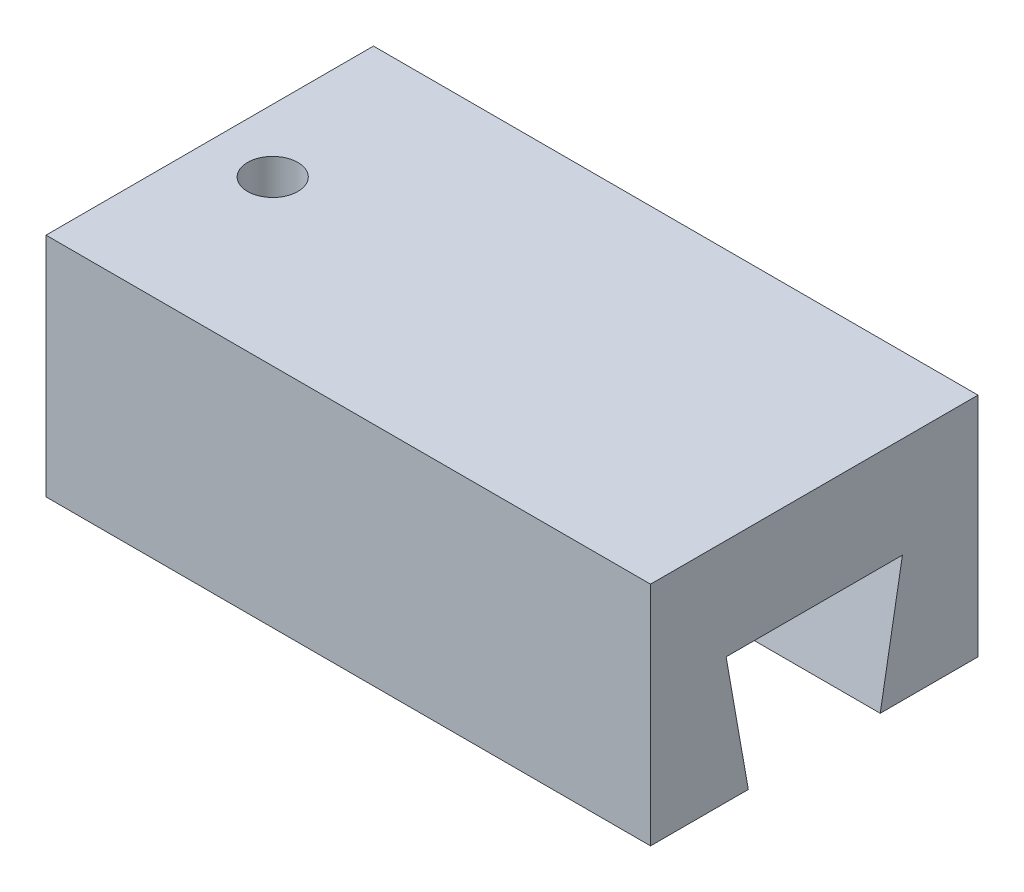
ISO-10303-21;
HEADER;
FILE_DESCRIPTION(('STEP AP214'),'2;1');
FILE_NAME('part.step','',(''),(''),'','','');
FILE_SCHEMA(('AUTOMOTIVE_DESIGN { 1 0 10303 214 1 1 1 1 }'));
ENDSEC;
DATA;
#1=APPLICATION_CONTEXT('core data for automotive mechanical design processes');
#2=APPLICATION_PROTOCOL_DEFINITION('international standard','automotive_design',2000,#1);
#3=PRODUCT_CONTEXT('',#1,'mechanical');
#4=PRODUCT('Part','Part','',(#3));
#5=PRODUCT_RELATED_PRODUCT_CATEGORY('part','',(#4));
#6=PRODUCT_DEFINITION_FORMATION('','',#4);
#7=PRODUCT_DEFINITION_CONTEXT('part definition',#1,'design');
#8=PRODUCT_DEFINITION('design','',#6,#7);
#9=PRODUCT_DEFINITION_SHAPE('','',#8);
#10=(LENGTH_UNIT() NAMED_UNIT(*) SI_UNIT(.MILLI.,.METRE.));
#11=(NAMED_UNIT(*) PLANE_ANGLE_UNIT() SI_UNIT($,.RADIAN.));
#12=(NAMED_UNIT(*) SI_UNIT($,.STERADIAN.) SOLID_ANGLE_UNIT());
#13=UNCERTAINTY_MEASURE_WITH_UNIT(LENGTH_MEASURE(1.E-05),#10,'distance_accuracy_value','');
#14=(GEOMETRIC_REPRESENTATION_CONTEXT(3) GLOBAL_UNCERTAINTY_ASSIGNED_CONTEXT((#13)) GLOBAL_UNIT_ASSIGNED_CONTEXT((#10,
#11,#12)) REPRESENTATION_CONTEXT('',''));
#15=CARTESIAN_POINT('',(0.,0.,0.));
#16=DIRECTION('',(0.,0.,1.));
#17=DIRECTION('',(1.,0.,0.));
#18=AXIS2_PLACEMENT_3D('',#15,#16,#17);
#19=CARTESIAN_POINT('',(0.,18.,0.));
#20=DIRECTION('',(1.,0.,0.));
#21=DIRECTION('',(0.,0.,-1.));
#22=AXIS2_PLACEMENT_3D('',#19,#20,#21);
#23=PLANE('',#22);
#24=DIRECTION('',(0.,-0.984807753012208,0.173648177666934));
#25=VECTOR('',#24,1.);
#26=CARTESIAN_POINT('',(0.,-3.11866453718628,-17.6868254912306));
#27=LINE('',#26,#25);
#28=CARTESIAN_POINT('',(0.,10.,-20.));
#29=VERTEX_POINT('',#28);
#30=CARTESIAN_POINT('',(0.,0.,-18.2367301929153));
#31=VERTEX_POINT('',#30);
#32=EDGE_CURVE('E127',#29,#31,#27,.T.);
#33=ORIENTED_EDGE('',*,*,#32,.F.);
#34=DIRECTION('',(0.,0.,-1.));
#35=VECTOR('',#34,1.);
#36=CARTESIAN_POINT('',(0.,10.,0.));
#37=LINE('',#36,#35);
#38=CARTESIAN_POINT('',(0.,10.,-5.99999999999996));
#39=VERTEX_POINT('',#38);
#40=EDGE_CURVE('E115',#39,#29,#37,.T.);
#41=ORIENTED_EDGE('',*,*,#40,.F.);
#42=DIRECTION('',(0.,-0.984807753012208,-0.173648177666934));
#43=VECTOR('',#42,1.);
#44=CARTESIAN_POINT('',(0.,1.32759732604749,-7.52917857898606));
#45=LINE('',#44,#43);
#46=CARTESIAN_POINT('',(0.,0.,-7.76326980708465));
#47=VERTEX_POINT('',#46);
#48=EDGE_CURVE('E126',#39,#47,#45,.T.);
#49=ORIENTED_EDGE('',*,*,#48,.T.);
#50=DIRECTION('',(0.,0.,1.));
#51=VECTOR('',#50,1.);
#52=CARTESIAN_POINT('',(0.,0.,0.));
#53=LINE('',#52,#51);
#54=CARTESIAN_POINT('',(0.,0.,0.));
#55=VERTEX_POINT('',#54);
#56=EDGE_CURVE('E160',#47,#55,#53,.T.);
#57=ORIENTED_EDGE('',*,*,#56,.T.);
#58=DIRECTION('',(0.,-1.,0.));
#59=VECTOR('',#58,1.);
#60=CARTESIAN_POINT('',(0.,18.,0.));
#61=LINE('',#60,#59);
#62=CARTESIAN_POINT('',(0.,18.,0.));
#63=VERTEX_POINT('',#62);
#64=EDGE_CURVE('E48',#63,#55,#61,.T.);
#65=ORIENTED_EDGE('',*,*,#64,.F.);
#66=DIRECTION('',(0.,0.,1.));
#67=VECTOR('',#66,1.);
#68=CARTESIAN_POINT('',(0.,18.,0.));
#69=LINE('',#68,#67);
#70=CARTESIAN_POINT('',(0.,18.,-26.));
#71=VERTEX_POINT('',#70);
#72=EDGE_CURVE('E161',#71,#63,#69,.T.);
#73=ORIENTED_EDGE('',*,*,#72,.F.);
#74=DIRECTION('',(0.,-1.,0.));
#75=VECTOR('',#74,1.);
#76=CARTESIAN_POINT('',(0.,18.,-26.));
#77=LINE('',#76,#75);
#78=CARTESIAN_POINT('',(0.,0.,-26.));
#79=VERTEX_POINT('',#78);
#80=EDGE_CURVE('E171',#71,#79,#77,.T.);
#81=ORIENTED_EDGE('',*,*,#80,.T.);
#82=EDGE_CURVE('E138',#79,#31,#53,.T.);
#83=ORIENTED_EDGE('',*,*,#82,.T.);
#84=EDGE_LOOP('',(#33,#41,#49,#57,#65,#73,#81,#83));
#85=FACE_BOUND('',#84,.T.);
#86=ADVANCED_FACE('F39',(#85),#23,.F.);
#87=CARTESIAN_POINT('',(48.,18.,0.));
#88=DIRECTION('',(-1.,0.,0.));
#89=DIRECTION('',(0.,0.,1.));
#90=AXIS2_PLACEMENT_3D('',#87,#88,#89);
#91=PLANE('',#90);
#92=DIRECTION('',(0.,0.984807753012207,-0.173648177666934));
#93=VECTOR('',#92,1.);
#94=CARTESIAN_POINT('',(48.,14.3385690498869,-20.7650067811618));
#95=LINE('',#94,#93);
#96=CARTESIAN_POINT('',(48.,0.,-18.2367301929153));
#97=VERTEX_POINT('',#96);
#98=CARTESIAN_POINT('',(48.,10.,-20.));
#99=VERTEX_POINT('',#98);
#100=EDGE_CURVE('E133',#97,#99,#95,.T.);
#101=ORIENTED_EDGE('',*,*,#100,.F.);
#102=DIRECTION('',(0.,0.,-1.));
#103=VECTOR('',#102,1.);
#104=CARTESIAN_POINT('',(48.,0.,0.));
#105=LINE('',#104,#103);
#106=CARTESIAN_POINT('',(48.,0.,-26.));
#107=VERTEX_POINT('',#106);
#108=EDGE_CURVE('E177',#97,#107,#105,.T.);
#109=ORIENTED_EDGE('',*,*,#108,.T.);
#110=DIRECTION('',(0.,-1.,0.));
#111=VECTOR('',#110,1.);
#112=CARTESIAN_POINT('',(48.,18.,-26.));
#113=LINE('',#112,#111);
#114=CARTESIAN_POINT('',(48.,18.,-26.));
#115=VERTEX_POINT('',#114);
#116=EDGE_CURVE('E186',#115,#107,#113,.T.);
#117=ORIENTED_EDGE('',*,*,#116,.F.);
#118=DIRECTION('',(0.,0.,-1.));
#119=VECTOR('',#118,1.);
#120=CARTESIAN_POINT('',(48.,18.,0.));
#121=LINE('',#120,#119);
#122=CARTESIAN_POINT('',(48.,18.,0.));
#123=VERTEX_POINT('',#122);
#124=EDGE_CURVE('E166',#123,#115,#121,.T.);
#125=ORIENTED_EDGE('',*,*,#124,.F.);
#126=DIRECTION('',(0.,-1.,0.));
#127=VECTOR('',#126,1.);
#128=CARTESIAN_POINT('',(48.,18.,0.));
#129=LINE('',#128,#127);
#130=CARTESIAN_POINT('',(48.,0.,0.));
#131=VERTEX_POINT('',#130);
#132=EDGE_CURVE('E189',#123,#131,#129,.T.);
#133=ORIENTED_EDGE('',*,*,#132,.T.);
#134=CARTESIAN_POINT('',(48.,0.,-7.76326980708466));
#135=VERTEX_POINT('',#134);
#136=EDGE_CURVE('E178',#131,#135,#105,.T.);
#137=ORIENTED_EDGE('',*,*,#136,.T.);
#138=DIRECTION('',(0.,0.984807753012207,0.173648177666934));
#139=VECTOR('',#138,1.);
#140=CARTESIAN_POINT('',(48.,18.7848309131206,-4.450997289055));
#141=LINE('',#140,#139);
#142=CARTESIAN_POINT('',(48.,10.,-5.99999999999998));
#143=VERTEX_POINT('',#142);
#144=EDGE_CURVE('E55',#135,#143,#141,.T.);
#145=ORIENTED_EDGE('',*,*,#144,.T.);
#146=DIRECTION('',(0.,0.,1.));
#147=VECTOR('',#146,1.);
#148=CARTESIAN_POINT('',(48.,10.,0.));
#149=LINE('',#148,#147);
#150=EDGE_CURVE('E11',#99,#143,#149,.T.);
#151=ORIENTED_EDGE('',*,*,#150,.F.);
#152=EDGE_LOOP('',(#101,#109,#117,#125,#133,#137,#145,#151));
#153=FACE_BOUND('',#152,.T.);
#154=ADVANCED_FACE('F204',(#153),#91,.F.);
#155=CARTESIAN_POINT('',(0.,0.,0.));
#156=DIRECTION('',(0.,-1.,0.));
#157=DIRECTION('',(0.,0.,-1.));
#158=AXIS2_PLACEMENT_3D('',#155,#156,#157);
#159=PLANE('',#158);
#160=ORIENTED_EDGE('',*,*,#108,.F.);
#161=DIRECTION('',(1.,0.,0.));
#162=VECTOR('',#161,1.);
#163=CARTESIAN_POINT('',(0.,0.,-18.2367301929153));
#164=LINE('',#163,#162);
#165=EDGE_CURVE('E148',#31,#97,#164,.T.);
#166=ORIENTED_EDGE('',*,*,#165,.F.);
#167=ORIENTED_EDGE('',*,*,#82,.F.);
#168=DIRECTION('',(-1.,0.,0.));
#169=VECTOR('',#168,1.);
#170=CARTESIAN_POINT('',(0.,0.,-26.));
#171=LINE('',#170,#169);
#172=EDGE_CURVE('E85',#107,#79,#171,.T.);
#173=ORIENTED_EDGE('',*,*,#172,.F.);
#174=EDGE_LOOP('',(#160,#166,#167,#173));
#175=FACE_BOUND('',#174,.T.);
#176=ADVANCED_FACE('F217',(#175),#159,.T.);
#177=CARTESIAN_POINT('',(0.,18.,0.));
#178=DIRECTION('',(0.,0.,-1.));
#179=DIRECTION('',(-1.,0.,0.));
#180=AXIS2_PLACEMENT_3D('',#177,#178,#179);
#181=PLANE('',#180);
#182=DIRECTION('',(1.,0.,0.));
#183=VECTOR('',#182,1.);
#184=CARTESIAN_POINT('',(0.,0.,0.));
#185=LINE('',#184,#183);
#186=EDGE_CURVE('E174',#55,#131,#185,.T.);
#187=ORIENTED_EDGE('',*,*,#186,.T.);
#188=ORIENTED_EDGE('',*,*,#132,.F.);
#189=DIRECTION('',(1.,0.,0.));
#190=VECTOR('',#189,1.);
#191=CARTESIAN_POINT('',(0.,18.,0.));
#192=LINE('',#191,#190);
#193=EDGE_CURVE('E93',#63,#123,#192,.T.);
#194=ORIENTED_EDGE('',*,*,#193,.F.);
#195=ORIENTED_EDGE('',*,*,#64,.T.);
#196=EDGE_LOOP('',(#187,#188,#194,#195));
#197=FACE_BOUND('',#196,.T.);
#198=ADVANCED_FACE('F195',(#197),#181,.F.);
#199=CARTESIAN_POINT('',(0.,18.,-26.));
#200=DIRECTION('',(0.,0.,1.));
#201=DIRECTION('',(1.,0.,0.));
#202=AXIS2_PLACEMENT_3D('',#199,#200,#201);
#203=PLANE('',#202);
#204=ORIENTED_EDGE('',*,*,#172,.T.);
#205=ORIENTED_EDGE('',*,*,#80,.F.);
#206=DIRECTION('',(-1.,0.,0.));
#207=VECTOR('',#206,1.);
#208=CARTESIAN_POINT('',(0.,18.,-26.));
#209=LINE('',#208,#207);
#210=EDGE_CURVE('E64',#115,#71,#209,.T.);
#211=ORIENTED_EDGE('',*,*,#210,.F.);
#212=ORIENTED_EDGE('',*,*,#116,.T.);
#213=EDGE_LOOP('',(#204,#205,#211,#212));
#214=FACE_BOUND('',#213,.T.);
#215=ADVANCED_FACE('F209',(#214),#203,.F.);
#216=CARTESIAN_POINT('',(0.,18.,0.));
#217=DIRECTION('',(0.,-1.,0.));
#218=DIRECTION('',(0.,0.,-1.));
#219=AXIS2_PLACEMENT_3D('',#216,#217,#218);
#220=PLANE('',#219);
#221=CARTESIAN_POINT('',(5.,18.,-13.));
#222=DIRECTION('',(0.,-1.,0.));
#223=DIRECTION('',(0.,0.,-1.));
#224=AXIS2_PLACEMENT_3D('',#221,#222,#223);
#225=CIRCLE('',#224,2.);
#226=CARTESIAN_POINT('',(5.,18.,-15.));
#227=VERTEX_POINT('',#226);
#228=EDGE_CURVE('E140',#227,#227,#225,.T.);
#229=ORIENTED_EDGE('',*,*,#228,.T.);
#230=EDGE_LOOP('',(#229));
#231=FACE_BOUND('',#230,.T.);
#232=ORIENTED_EDGE('',*,*,#72,.T.);
#233=ORIENTED_EDGE('',*,*,#193,.T.);
#234=ORIENTED_EDGE('',*,*,#124,.T.);
#235=ORIENTED_EDGE('',*,*,#210,.T.);
#236=EDGE_LOOP('',(#232,#233,#234,#235));
#237=FACE_BOUND('',#236,.T.);
#238=ADVANCED_FACE('F207',(#231,#237),#220,.F.);
#239=DIRECTION('',(1.,0.,0.));
#240=VECTOR('',#239,1.);
#241=CARTESIAN_POINT('',(0.,0.,-7.76326980708465));
#242=LINE('',#241,#240);
#243=EDGE_CURVE('E151',#47,#135,#242,.T.);
#244=ORIENTED_EDGE('',*,*,#243,.T.);
#245=ORIENTED_EDGE('',*,*,#136,.F.);
#246=ORIENTED_EDGE('',*,*,#186,.F.);
#247=ORIENTED_EDGE('',*,*,#56,.F.);
#248=EDGE_LOOP('',(#244,#245,#246,#247));
#249=FACE_BOUND('',#248,.T.);
#250=ADVANCED_FACE('F202',(#249),#159,.T.);
#251=CARTESIAN_POINT('',(0.,10.,0.));
#252=DIRECTION('',(0.,-1.,0.));
#253=DIRECTION('',(0.,0.,-1.));
#254=AXIS2_PLACEMENT_3D('',#251,#252,#253);
#255=PLANE('',#254);
#256=CARTESIAN_POINT('',(5.,10.,-13.));
#257=DIRECTION('',(0.,-1.,0.));
#258=DIRECTION('',(0.,0.,-1.));
#259=AXIS2_PLACEMENT_3D('',#256,#257,#258);
#260=CIRCLE('',#259,2.);
#261=CARTESIAN_POINT('',(5.,10.,-15.));
#262=VERTEX_POINT('',#261);
#263=EDGE_CURVE('E42',#262,#262,#260,.T.);
#264=ORIENTED_EDGE('',*,*,#263,.F.);
#265=EDGE_LOOP('',(#264));
#266=FACE_BOUND('',#265,.T.);
#267=ORIENTED_EDGE('',*,*,#150,.T.);
#268=DIRECTION('',(1.,0.,0.));
#269=VECTOR('',#268,1.);
#270=CARTESIAN_POINT('',(0.,10.,-5.99999999999996));
#271=LINE('',#270,#269);
#272=EDGE_CURVE('E120',#39,#143,#271,.T.);
#273=ORIENTED_EDGE('',*,*,#272,.F.);
#274=ORIENTED_EDGE('',*,*,#40,.T.);
#275=DIRECTION('',(1.,0.,0.));
#276=VECTOR('',#275,1.);
#277=CARTESIAN_POINT('',(0.,10.,-20.));
#278=LINE('',#277,#276);
#279=EDGE_CURVE('E118',#29,#99,#278,.T.);
#280=ORIENTED_EDGE('',*,*,#279,.T.);
#281=EDGE_LOOP('',(#267,#273,#274,#280));
#282=FACE_BOUND('',#281,.T.);
#283=ADVANCED_FACE('F117',(#266,#282),#255,.T.);
#284=CARTESIAN_POINT('',(0.,-3.11866453718628,-17.6868254912306));
#285=DIRECTION('',(0.,0.173648177666934,0.984807753012207));
#286=DIRECTION('',(0.,-0.984807753012207,0.173648177666934));
#287=AXIS2_PLACEMENT_3D('',#284,#285,#286);
#288=PLANE('',#287);
#289=ORIENTED_EDGE('',*,*,#100,.T.);
#290=ORIENTED_EDGE('',*,*,#279,.F.);
#291=ORIENTED_EDGE('',*,*,#32,.T.);
#292=ORIENTED_EDGE('',*,*,#165,.T.);
#293=EDGE_LOOP('',(#289,#290,#291,#292));
#294=FACE_BOUND('',#293,.T.);
#295=ADVANCED_FACE('F130',(#294),#288,.T.);
#296=CARTESIAN_POINT('',(0.,1.32759732604749,-7.52917857898606));
#297=DIRECTION('',(0.,-0.173648177666934,0.984807753012207));
#298=DIRECTION('',(0.,-0.984807753012207,-0.173648177666934));
#299=AXIS2_PLACEMENT_3D('',#296,#297,#298);
#300=PLANE('',#299);
#301=ORIENTED_EDGE('',*,*,#243,.F.);
#302=ORIENTED_EDGE('',*,*,#48,.F.);
#303=ORIENTED_EDGE('',*,*,#272,.T.);
#304=ORIENTED_EDGE('',*,*,#144,.F.);
#305=EDGE_LOOP('',(#301,#302,#303,#304));
#306=FACE_BOUND('',#305,.T.);
#307=ADVANCED_FACE('F268',(#306),#300,.F.);
#308=CARTESIAN_POINT('',(5.,0.,-13.));
#309=DIRECTION('',(0.,1.,0.));
#310=DIRECTION('',(0.,0.,1.));
#311=AXIS2_PLACEMENT_3D('',#308,#309,#310);
#312=CYLINDRICAL_SURFACE('',#311,2.);
#313=ORIENTED_EDGE('',*,*,#263,.T.);
#314=EDGE_LOOP('',(#313));
#315=FACE_BOUND('',#314,.T.);
#316=ORIENTED_EDGE('',*,*,#228,.F.);
#317=EDGE_LOOP('',(#316));
#318=FACE_BOUND('',#317,.T.);
#319=ADVANCED_FACE('F275',(#315,#318),#312,.F.);
#320=CLOSED_SHELL('',(#86,#154,#176,#198,#215,#238,#250,#283,#295,#307,#319));
#321=MANIFOLD_SOLID_BREP('B2',#320);
#322=ADVANCED_BREP_SHAPE_REPRESENTATION('',(#18,#321),#14);
#323=SHAPE_DEFINITION_REPRESENTATION(#9,#322);
ENDSEC;
END-ISO-10303-21;
